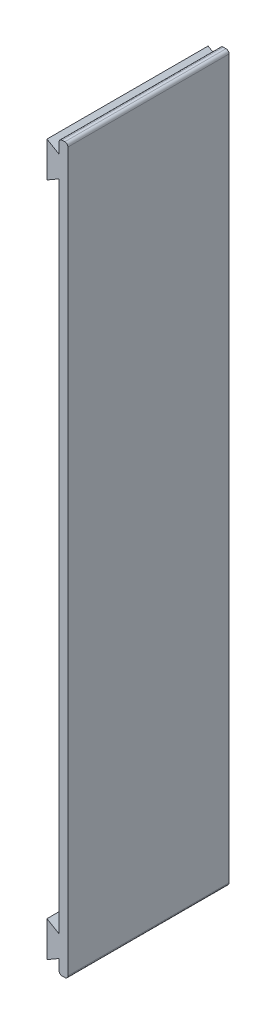
ISO-10303-21;
HEADER;
FILE_DESCRIPTION(('STEP AP214'),'2;1');
FILE_NAME('part.step','',(''),(''),'','','');
FILE_SCHEMA(('AUTOMOTIVE_DESIGN { 1 0 10303 214 1 1 1 1 }'));
ENDSEC;
DATA;
#1=APPLICATION_CONTEXT('core data for automotive mechanical design processes');
#2=APPLICATION_PROTOCOL_DEFINITION('international standard','automotive_design',2000,#1);
#3=PRODUCT_CONTEXT('',#1,'mechanical');
#4=PRODUCT('Part','Part','',(#3));
#5=PRODUCT_RELATED_PRODUCT_CATEGORY('part','',(#4));
#6=PRODUCT_DEFINITION_FORMATION('','',#4);
#7=PRODUCT_DEFINITION_CONTEXT('part definition',#1,'design');
#8=PRODUCT_DEFINITION('design','',#6,#7);
#9=PRODUCT_DEFINITION_SHAPE('','',#8);
#10=(LENGTH_UNIT() NAMED_UNIT(*) SI_UNIT(.MILLI.,.METRE.));
#11=(NAMED_UNIT(*) PLANE_ANGLE_UNIT() SI_UNIT($,.RADIAN.));
#12=(NAMED_UNIT(*) SI_UNIT($,.STERADIAN.) SOLID_ANGLE_UNIT());
#13=UNCERTAINTY_MEASURE_WITH_UNIT(LENGTH_MEASURE(1.E-05),#10,'distance_accuracy_value','');
#14=(GEOMETRIC_REPRESENTATION_CONTEXT(3) GLOBAL_UNCERTAINTY_ASSIGNED_CONTEXT((#13)) GLOBAL_UNIT_ASSIGNED_CONTEXT((#10,
#11,#12)) REPRESENTATION_CONTEXT('',''));
#15=CARTESIAN_POINT('',(0.,0.,0.));
#16=DIRECTION('',(0.,0.,1.));
#17=DIRECTION('',(1.,0.,0.));
#18=AXIS2_PLACEMENT_3D('',#15,#16,#17);
#19=CARTESIAN_POINT('',(2.9,0.,53.));
#20=DIRECTION('',(0.,-1.,0.));
#21=DIRECTION('',(1.,0.,0.));
#22=AXIS2_PLACEMENT_3D('',#19,#20,#21);
#23=PLANE('',#22);
#24=DIRECTION('',(-1.,0.,0.));
#25=VECTOR('',#24,1.);
#26=CARTESIAN_POINT('',(2.9,0.,53.));
#27=LINE('',#26,#25);
#28=CARTESIAN_POINT('',(1.9,0.,53.));
#29=VERTEX_POINT('',#28);
#30=CARTESIAN_POINT('',(1.,0.,53.));
#31=VERTEX_POINT('',#30);
#32=EDGE_CURVE('E228',#29,#31,#27,.T.);
#33=ORIENTED_EDGE('',*,*,#32,.F.);
#34=DIRECTION('',(0.,0.,-1.));
#35=VECTOR('',#34,1.);
#36=CARTESIAN_POINT('',(1.9,0.,53.));
#37=LINE('',#36,#35);
#38=CARTESIAN_POINT('',(1.9,0.,0.));
#39=VERTEX_POINT('',#38);
#40=EDGE_CURVE('E387',#29,#39,#37,.T.);
#41=ORIENTED_EDGE('',*,*,#40,.T.);
#42=DIRECTION('',(-1.,0.,0.));
#43=VECTOR('',#42,1.);
#44=CARTESIAN_POINT('',(2.9,0.,0.));
#45=LINE('',#44,#43);
#46=CARTESIAN_POINT('',(1.,0.,0.));
#47=VERTEX_POINT('',#46);
#48=EDGE_CURVE('E278',#39,#47,#45,.T.);
#49=ORIENTED_EDGE('',*,*,#48,.T.);
#50=DIRECTION('',(0.,0.,-1.));
#51=VECTOR('',#50,1.);
#52=CARTESIAN_POINT('',(1.,0.,53.));
#53=LINE('',#52,#51);
#54=EDGE_CURVE('E384',#47,#31,#53,.F.);
#55=ORIENTED_EDGE('',*,*,#54,.T.);
#56=EDGE_LOOP('',(#33,#41,#49,#55));
#57=FACE_BOUND('',#56,.T.);
#58=ADVANCED_FACE('F41',(#57),#23,.F.);
#59=CARTESIAN_POINT('',(0.,0.,53.));
#60=DIRECTION('',(1.,0.,0.));
#61=DIRECTION('',(0.,1.,0.));
#62=AXIS2_PLACEMENT_3D('',#59,#60,#61);
#63=PLANE('',#62);
#64=DIRECTION('',(0.,-1.,0.));
#65=VECTOR('',#64,1.);
#66=CARTESIAN_POINT('',(0.,0.,53.));
#67=LINE('',#66,#65);
#68=CARTESIAN_POINT('',(0.,-1.,53.));
#69=VERTEX_POINT('',#68);
#70=CARTESIAN_POINT('',(0.,-4.48,53.));
#71=VERTEX_POINT('',#70);
#72=EDGE_CURVE('E214',#69,#71,#67,.T.);
#73=ORIENTED_EDGE('',*,*,#72,.F.);
#74=DIRECTION('',(0.,0.,-1.));
#75=VECTOR('',#74,1.);
#76=CARTESIAN_POINT('',(0.,-1.,53.));
#77=LINE('',#76,#75);
#78=CARTESIAN_POINT('',(0.,-1.,0.));
#79=VERTEX_POINT('',#78);
#80=EDGE_CURVE('E391',#69,#79,#77,.T.);
#81=ORIENTED_EDGE('',*,*,#80,.T.);
#82=DIRECTION('',(0.,-1.,0.));
#83=VECTOR('',#82,1.);
#84=CARTESIAN_POINT('',(0.,0.,0.));
#85=LINE('',#84,#83);
#86=CARTESIAN_POINT('',(0.,-4.48,0.));
#87=VERTEX_POINT('',#86);
#88=EDGE_CURVE('E234',#79,#87,#85,.T.);
#89=ORIENTED_EDGE('',*,*,#88,.T.);
#90=DIRECTION('',(0.,0.,-1.));
#91=VECTOR('',#90,1.);
#92=CARTESIAN_POINT('',(0.,-4.48,53.));
#93=LINE('',#92,#91);
#94=EDGE_CURVE('E231',#71,#87,#93,.T.);
#95=ORIENTED_EDGE('',*,*,#94,.F.);
#96=EDGE_LOOP('',(#73,#81,#89,#95));
#97=FACE_BOUND('',#96,.T.);
#98=ADVANCED_FACE('F232',(#97),#63,.F.);
#99=CARTESIAN_POINT('',(0.,-4.48,53.));
#100=DIRECTION('',(-0.500000000000013,-0.866025403784431,0.));
#101=DIRECTION('',(0.866025403784431,-0.500000000000013,0.));
#102=AXIS2_PLACEMENT_3D('',#99,#100,#101);
#103=PLANE('',#102);
#104=DIRECTION('',(-0.866025403784431,0.500000000000013,0.));
#105=VECTOR('',#104,1.);
#106=CARTESIAN_POINT('',(0.,-4.48,0.));
#107=LINE('',#106,#105);
#108=CARTESIAN_POINT('',(-3.99237711144618,-2.17499999999997,0.));
#109=VERTEX_POINT('',#108);
#110=EDGE_CURVE('E285',#87,#109,#107,.T.);
#111=ORIENTED_EDGE('',*,*,#110,.T.);
#112=DIRECTION('',(0.,0.,-1.));
#113=VECTOR('',#112,1.);
#114=CARTESIAN_POINT('',(-3.99237711144618,-2.17499999999997,53.));
#115=LINE('',#114,#113);
#116=CARTESIAN_POINT('',(-3.99237711144618,-2.17499999999997,53.));
#117=VERTEX_POINT('',#116);
#118=EDGE_CURVE('E239',#117,#109,#115,.T.);
#119=ORIENTED_EDGE('',*,*,#118,.F.);
#120=DIRECTION('',(-0.866025403784431,0.500000000000013,0.));
#121=VECTOR('',#120,1.);
#122=CARTESIAN_POINT('',(0.,-4.48,53.));
#123=LINE('',#122,#121);
#124=EDGE_CURVE('E219',#71,#117,#123,.T.);
#125=ORIENTED_EDGE('',*,*,#124,.F.);
#126=ORIENTED_EDGE('',*,*,#94,.T.);
#127=EDGE_LOOP('',(#111,#119,#125,#126));
#128=FACE_BOUND('',#127,.T.);
#129=ADVANCED_FACE('F241',(#128),#103,.F.);
#130=CARTESIAN_POINT('',(-3.99237711144618,-2.17499999999997,53.));
#131=DIRECTION('',(1.,0.,0.));
#132=DIRECTION('',(0.,1.,0.));
#133=AXIS2_PLACEMENT_3D('',#130,#131,#132);
#134=PLANE('',#133);
#135=DIRECTION('',(0.,-1.,0.));
#136=VECTOR('',#135,1.);
#137=CARTESIAN_POINT('',(-3.99237711144618,-2.17499999999997,0.));
#138=LINE('',#137,#136);
#139=CARTESIAN_POINT('',(-3.99237711144618,-13.825,0.));
#140=VERTEX_POINT('',#139);
#141=EDGE_CURVE('E288',#109,#140,#138,.T.);
#142=ORIENTED_EDGE('',*,*,#141,.T.);
#143=DIRECTION('',(0.,0.,-1.));
#144=VECTOR('',#143,1.);
#145=CARTESIAN_POINT('',(-3.99237711144618,-13.825,53.));
#146=LINE('',#145,#144);
#147=CARTESIAN_POINT('',(-3.99237711144618,-13.825,53.));
#148=VERTEX_POINT('',#147);
#149=EDGE_CURVE('E339',#148,#140,#146,.T.);
#150=ORIENTED_EDGE('',*,*,#149,.F.);
#151=DIRECTION('',(0.,-1.,0.));
#152=VECTOR('',#151,1.);
#153=CARTESIAN_POINT('',(-3.99237711144618,-2.17499999999997,53.));
#154=LINE('',#153,#152);
#155=EDGE_CURVE('E245',#117,#148,#154,.T.);
#156=ORIENTED_EDGE('',*,*,#155,.F.);
#157=ORIENTED_EDGE('',*,*,#118,.T.);
#158=EDGE_LOOP('',(#142,#150,#156,#157));
#159=FACE_BOUND('',#158,.T.);
#160=ADVANCED_FACE('F525',(#159),#134,.F.);
#161=CARTESIAN_POINT('',(0.,-11.52,53.));
#162=DIRECTION('',(-0.499999999999998,0.86602540378444,0.));
#163=DIRECTION('',(-0.86602540378444,-0.499999999999998,0.));
#164=AXIS2_PLACEMENT_3D('',#161,#162,#163);
#165=PLANE('',#164);
#166=DIRECTION('',(0.86602540378444,0.499999999999998,0.));
#167=VECTOR('',#166,1.);
#168=CARTESIAN_POINT('',(0.,-11.52,0.));
#169=LINE('',#168,#167);
#170=CARTESIAN_POINT('',(0.,-11.52,0.));
#171=VERTEX_POINT('',#170);
#172=EDGE_CURVE('E291',#140,#171,#169,.T.);
#173=ORIENTED_EDGE('',*,*,#172,.T.);
#174=DIRECTION('',(0.,0.,-1.));
#175=VECTOR('',#174,1.);
#176=CARTESIAN_POINT('',(0.,-11.52,53.));
#177=LINE('',#176,#175);
#178=CARTESIAN_POINT('',(0.,-11.52,53.));
#179=VERTEX_POINT('',#178);
#180=EDGE_CURVE('E335',#179,#171,#177,.T.);
#181=ORIENTED_EDGE('',*,*,#180,.F.);
#182=DIRECTION('',(0.86602540378444,0.499999999999998,0.));
#183=VECTOR('',#182,1.);
#184=CARTESIAN_POINT('',(0.,-11.52,53.));
#185=LINE('',#184,#183);
#186=EDGE_CURVE('E248',#148,#179,#185,.T.);
#187=ORIENTED_EDGE('',*,*,#186,.F.);
#188=ORIENTED_EDGE('',*,*,#149,.T.);
#189=EDGE_LOOP('',(#173,#181,#187,#188));
#190=FACE_BOUND('',#189,.T.);
#191=ADVANCED_FACE('F532',(#190),#165,.F.);
#192=CARTESIAN_POINT('',(0.,-226.48,53.));
#193=DIRECTION('',(1.,0.,0.));
#194=DIRECTION('',(0.,1.,0.));
#195=AXIS2_PLACEMENT_3D('',#192,#193,#194);
#196=PLANE('',#195);
#197=DIRECTION('',(0.,0.,1.));
#198=VECTOR('',#197,1.);
#199=CARTESIAN_POINT('',(-2.12901654943528E-13,-58.5,0.));
#200=LINE('',#199,#198);
#201=CARTESIAN_POINT('',(-2.12901654943528E-13,-58.5,1.));
#202=VERTEX_POINT('',#201);
#203=CARTESIAN_POINT('',(-2.12901654943528E-13,-58.5,1.79999999999999));
#204=VERTEX_POINT('',#203);
#205=EDGE_CURVE('E497',#202,#204,#200,.T.);
#206=ORIENTED_EDGE('',*,*,#205,.T.);
#207=CARTESIAN_POINT('',(0.,-59.5,1.79999999999999));
#208=DIRECTION('',(1.,0.,0.));
#209=DIRECTION('',(0.,1.,0.));
#210=AXIS2_PLACEMENT_3D('',#207,#208,#209);
#211=CIRCLE('',#210,1.);
#212=CARTESIAN_POINT('',(-2.16540999472477E-13,-59.5,2.79999999999999));
#213=VERTEX_POINT('',#212);
#214=EDGE_CURVE('E11',#204,#213,#211,.T.);
#215=ORIENTED_EDGE('',*,*,#214,.T.);
#216=DIRECTION('',(0.,-1.,0.));
#217=VECTOR('',#216,1.);
#218=CARTESIAN_POINT('',(-2.12901654943528E-13,-58.5,2.79999999999999));
#219=LINE('',#218,#217);
#220=CARTESIAN_POINT('',(-6.49622998417432E-13,-178.5,2.79999999999998));
#221=VERTEX_POINT('',#220);
#222=EDGE_CURVE('E501',#213,#221,#219,.T.);
#223=ORIENTED_EDGE('',*,*,#222,.T.);
#224=CARTESIAN_POINT('',(0.,-178.5,1.79999999999998));
#225=DIRECTION('',(1.,0.,0.));
#226=DIRECTION('',(0.,1.,0.));
#227=AXIS2_PLACEMENT_3D('',#224,#225,#226);
#228=CIRCLE('',#227,1.);
#229=CARTESIAN_POINT('',(-6.53262342946381E-13,-179.5,1.79999999999998));
#230=VERTEX_POINT('',#229);
#231=EDGE_CURVE('E447',#221,#230,#228,.T.);
#232=ORIENTED_EDGE('',*,*,#231,.T.);
#233=DIRECTION('',(0.,0.,-1.));
#234=VECTOR('',#233,1.);
#235=CARTESIAN_POINT('',(-6.53262342946381E-13,-179.5,2.79999999999998));
#236=LINE('',#235,#234);
#237=CARTESIAN_POINT('',(-6.53262342946381E-13,-179.5,1.));
#238=VERTEX_POINT('',#237);
#239=EDGE_CURVE('E282',#230,#238,#236,.T.);
#240=ORIENTED_EDGE('',*,*,#239,.T.);
#241=CARTESIAN_POINT('',(0.,-178.5,1.));
#242=DIRECTION('',(1.,0.,0.));
#243=DIRECTION('',(0.,1.,0.));
#244=AXIS2_PLACEMENT_3D('',#241,#242,#243);
#245=CIRCLE('',#244,1.);
#246=CARTESIAN_POINT('',(0.,-178.5,0.));
#247=VERTEX_POINT('',#246);
#248=EDGE_CURVE('E443',#238,#247,#245,.T.);
#249=ORIENTED_EDGE('',*,*,#248,.T.);
#250=DIRECTION('',(0.,-1.,0.));
#251=VECTOR('',#250,1.);
#252=CARTESIAN_POINT('',(0.,-226.48,0.));
#253=LINE('',#252,#251);
#254=CARTESIAN_POINT('',(0.,-226.48,0.));
#255=VERTEX_POINT('',#254);
#256=EDGE_CURVE('E295',#247,#255,#253,.T.);
#257=ORIENTED_EDGE('',*,*,#256,.T.);
#258=DIRECTION('',(0.,0.,-1.));
#259=VECTOR('',#258,1.);
#260=CARTESIAN_POINT('',(0.,-226.48,53.));
#261=LINE('',#260,#259);
#262=CARTESIAN_POINT('',(0.,-226.48,53.));
#263=VERTEX_POINT('',#262);
#264=EDGE_CURVE('E331',#263,#255,#261,.T.);
#265=ORIENTED_EDGE('',*,*,#264,.F.);
#266=DIRECTION('',(0.,-1.,0.));
#267=VECTOR('',#266,1.);
#268=CARTESIAN_POINT('',(0.,-11.52,53.));
#269=LINE('',#268,#267);
#270=EDGE_CURVE('E254',#179,#263,#269,.T.);
#271=ORIENTED_EDGE('',*,*,#270,.F.);
#272=ORIENTED_EDGE('',*,*,#180,.T.);
#273=CARTESIAN_POINT('',(0.,-59.5,0.));
#274=VERTEX_POINT('',#273);
#275=EDGE_CURVE('E296',#171,#274,#253,.T.);
#276=ORIENTED_EDGE('',*,*,#275,.T.);
#277=CARTESIAN_POINT('',(0.,-59.5,1.));
#278=DIRECTION('',(1.,0.,0.));
#279=DIRECTION('',(0.,1.,0.));
#280=AXIS2_PLACEMENT_3D('',#277,#278,#279);
#281=CIRCLE('',#280,1.);
#282=EDGE_CURVE('E51',#274,#202,#281,.T.);
#283=ORIENTED_EDGE('',*,*,#282,.T.);
#284=EDGE_LOOP('',(#206,#215,#223,#232,#240,#249,#257,#265,#271,#272,#276,#283));
#285=FACE_BOUND('',#284,.T.);
#286=ADVANCED_FACE('F533',(#285),#196,.F.);
#287=CARTESIAN_POINT('',(0.,-226.48,53.));
#288=DIRECTION('',(-0.500000000000003,-0.866025403784437,0.));
#289=DIRECTION('',(0.866025403784437,-0.500000000000002,0.));
#290=AXIS2_PLACEMENT_3D('',#287,#288,#289);
#291=PLANE('',#290);
#292=DIRECTION('',(-0.866025403784437,0.500000000000002,0.));
#293=VECTOR('',#292,1.);
#294=CARTESIAN_POINT('',(0.,-226.48,0.));
#295=LINE('',#294,#293);
#296=CARTESIAN_POINT('',(-3.99237711144621,-224.175,0.));
#297=VERTEX_POINT('',#296);
#298=EDGE_CURVE('E299',#255,#297,#295,.T.);
#299=ORIENTED_EDGE('',*,*,#298,.T.);
#300=DIRECTION('',(0.,0.,-1.));
#301=VECTOR('',#300,1.);
#302=CARTESIAN_POINT('',(-3.99237711144621,-224.175,53.));
#303=LINE('',#302,#301);
#304=CARTESIAN_POINT('',(-3.99237711144621,-224.175,53.));
#305=VERTEX_POINT('',#304);
#306=EDGE_CURVE('E327',#305,#297,#303,.T.);
#307=ORIENTED_EDGE('',*,*,#306,.F.);
#308=DIRECTION('',(-0.866025403784437,0.500000000000002,0.));
#309=VECTOR('',#308,1.);
#310=CARTESIAN_POINT('',(0.,-226.48,53.));
#311=LINE('',#310,#309);
#312=EDGE_CURVE('E257',#263,#305,#311,.T.);
#313=ORIENTED_EDGE('',*,*,#312,.F.);
#314=ORIENTED_EDGE('',*,*,#264,.T.);
#315=EDGE_LOOP('',(#299,#307,#313,#314));
#316=FACE_BOUND('',#315,.T.);
#317=ADVANCED_FACE('F538',(#316),#291,.F.);
#318=CARTESIAN_POINT('',(-3.99237711144621,-235.825,53.));
#319=DIRECTION('',(1.,0.,0.));
#320=DIRECTION('',(0.,1.,0.));
#321=AXIS2_PLACEMENT_3D('',#318,#319,#320);
#322=PLANE('',#321);
#323=DIRECTION('',(0.,-1.,0.));
#324=VECTOR('',#323,1.);
#325=CARTESIAN_POINT('',(-3.99237711144621,-235.825,0.));
#326=LINE('',#325,#324);
#327=CARTESIAN_POINT('',(-3.99237711144621,-235.825,0.));
#328=VERTEX_POINT('',#327);
#329=EDGE_CURVE('E302',#297,#328,#326,.T.);
#330=ORIENTED_EDGE('',*,*,#329,.T.);
#331=DIRECTION('',(0.,0.,-1.));
#332=VECTOR('',#331,1.);
#333=CARTESIAN_POINT('',(-3.99237711144621,-235.825,53.));
#334=LINE('',#333,#332);
#335=CARTESIAN_POINT('',(-3.99237711144621,-235.825,53.));
#336=VERTEX_POINT('',#335);
#337=EDGE_CURVE('E323',#336,#328,#334,.T.);
#338=ORIENTED_EDGE('',*,*,#337,.F.);
#339=DIRECTION('',(0.,-1.,0.));
#340=VECTOR('',#339,1.);
#341=CARTESIAN_POINT('',(-3.99237711144621,-235.825,53.));
#342=LINE('',#341,#340);
#343=EDGE_CURVE('E260',#305,#336,#342,.T.);
#344=ORIENTED_EDGE('',*,*,#343,.F.);
#345=ORIENTED_EDGE('',*,*,#306,.T.);
#346=EDGE_LOOP('',(#330,#338,#344,#345));
#347=FACE_BOUND('',#346,.T.);
#348=ADVANCED_FACE('F544',(#347),#322,.F.);
#349=CARTESIAN_POINT('',(0.,-233.52,53.));
#350=DIRECTION('',(-0.499999999999996,0.866025403784441,0.));
#351=DIRECTION('',(-0.866025403784441,-0.499999999999996,0.));
#352=AXIS2_PLACEMENT_3D('',#349,#350,#351);
#353=PLANE('',#352);
#354=DIRECTION('',(0.866025403784441,0.499999999999996,0.));
#355=VECTOR('',#354,1.);
#356=CARTESIAN_POINT('',(0.,-233.52,0.));
#357=LINE('',#356,#355);
#358=CARTESIAN_POINT('',(0.,-233.52,0.));
#359=VERTEX_POINT('',#358);
#360=EDGE_CURVE('E305',#328,#359,#357,.T.);
#361=ORIENTED_EDGE('',*,*,#360,.T.);
#362=DIRECTION('',(0.,0.,-1.));
#363=VECTOR('',#362,1.);
#364=CARTESIAN_POINT('',(0.,-233.52,53.));
#365=LINE('',#364,#363);
#366=CARTESIAN_POINT('',(0.,-233.52,53.));
#367=VERTEX_POINT('',#366);
#368=EDGE_CURVE('E277',#367,#359,#365,.T.);
#369=ORIENTED_EDGE('',*,*,#368,.F.);
#370=DIRECTION('',(0.866025403784441,0.499999999999996,0.));
#371=VECTOR('',#370,1.);
#372=CARTESIAN_POINT('',(0.,-233.52,53.));
#373=LINE('',#372,#371);
#374=EDGE_CURVE('E263',#336,#367,#373,.T.);
#375=ORIENTED_EDGE('',*,*,#374,.F.);
#376=ORIENTED_EDGE('',*,*,#337,.T.);
#377=EDGE_LOOP('',(#361,#369,#375,#376));
#378=FACE_BOUND('',#377,.T.);
#379=ADVANCED_FACE('F548',(#378),#353,.F.);
#380=CARTESIAN_POINT('',(0.,-238.,53.));
#381=DIRECTION('',(1.,0.,0.));
#382=DIRECTION('',(0.,1.,0.));
#383=AXIS2_PLACEMENT_3D('',#380,#381,#382);
#384=PLANE('',#383);
#385=DIRECTION('',(0.,-1.,0.));
#386=VECTOR('',#385,1.);
#387=CARTESIAN_POINT('',(0.,-238.,0.));
#388=LINE('',#387,#386);
#389=CARTESIAN_POINT('',(0.,-237.,0.));
#390=VERTEX_POINT('',#389);
#391=EDGE_CURVE('E308',#359,#390,#388,.T.);
#392=ORIENTED_EDGE('',*,*,#391,.T.);
#393=DIRECTION('',(0.,0.,-1.));
#394=VECTOR('',#393,1.);
#395=CARTESIAN_POINT('',(0.,-237.,53.));
#396=LINE('',#395,#394);
#397=CARTESIAN_POINT('',(0.,-237.,53.));
#398=VERTEX_POINT('',#397);
#399=EDGE_CURVE('E363',#390,#398,#396,.F.);
#400=ORIENTED_EDGE('',*,*,#399,.T.);
#401=DIRECTION('',(0.,-1.,0.));
#402=VECTOR('',#401,1.);
#403=CARTESIAN_POINT('',(0.,-238.,53.));
#404=LINE('',#403,#402);
#405=EDGE_CURVE('E266',#367,#398,#404,.T.);
#406=ORIENTED_EDGE('',*,*,#405,.F.);
#407=ORIENTED_EDGE('',*,*,#368,.T.);
#408=EDGE_LOOP('',(#392,#400,#406,#407));
#409=FACE_BOUND('',#408,.T.);
#410=ADVANCED_FACE('F552',(#409),#384,.F.);
#411=CARTESIAN_POINT('',(2.9,-238.,53.));
#412=DIRECTION('',(0.,1.,0.));
#413=DIRECTION('',(-1.,0.,0.));
#414=AXIS2_PLACEMENT_3D('',#411,#412,#413);
#415=PLANE('',#414);
#416=DIRECTION('',(1.,0.,0.));
#417=VECTOR('',#416,1.);
#418=CARTESIAN_POINT('',(2.9,-238.,53.));
#419=LINE('',#418,#417);
#420=CARTESIAN_POINT('',(0.999999999999991,-238.,53.));
#421=VERTEX_POINT('',#420);
#422=CARTESIAN_POINT('',(1.89999999999999,-238.,53.));
#423=VERTEX_POINT('',#422);
#424=EDGE_CURVE('E269',#421,#423,#419,.T.);
#425=ORIENTED_EDGE('',*,*,#424,.F.);
#426=DIRECTION('',(0.,0.,-1.));
#427=VECTOR('',#426,1.);
#428=CARTESIAN_POINT('',(0.999999999999991,-238.,53.));
#429=LINE('',#428,#427);
#430=CARTESIAN_POINT('',(0.999999999999991,-238.,0.));
#431=VERTEX_POINT('',#430);
#432=EDGE_CURVE('E347',#421,#431,#429,.T.);
#433=ORIENTED_EDGE('',*,*,#432,.T.);
#434=DIRECTION('',(1.,0.,0.));
#435=VECTOR('',#434,1.);
#436=CARTESIAN_POINT('',(2.9,-238.,0.));
#437=LINE('',#436,#435);
#438=CARTESIAN_POINT('',(1.89999999999999,-238.,0.));
#439=VERTEX_POINT('',#438);
#440=EDGE_CURVE('E312',#431,#439,#437,.T.);
#441=ORIENTED_EDGE('',*,*,#440,.T.);
#442=DIRECTION('',(0.,0.,-1.));
#443=VECTOR('',#442,1.);
#444=CARTESIAN_POINT('',(1.89999999999999,-238.,53.));
#445=LINE('',#444,#443);
#446=EDGE_CURVE('E238',#439,#423,#445,.F.);
#447=ORIENTED_EDGE('',*,*,#446,.T.);
#448=EDGE_LOOP('',(#425,#433,#441,#447));
#449=FACE_BOUND('',#448,.T.);
#450=ADVANCED_FACE('F561',(#449),#415,.F.);
#451=CARTESIAN_POINT('',(2.9,-7.4587695629972,53.));
#452=DIRECTION('',(-1.,0.,0.));
#453=DIRECTION('',(0.,0.,1.));
#454=AXIS2_PLACEMENT_3D('',#451,#452,#453);
#455=PLANE('',#454);
#456=DIRECTION('',(0.,1.,0.));
#457=VECTOR('',#456,1.);
#458=CARTESIAN_POINT('',(2.9,-230.541230437003,53.));
#459=LINE('',#458,#457);
#460=CARTESIAN_POINT('',(2.9,-237.,53.));
#461=VERTEX_POINT('',#460);
#462=CARTESIAN_POINT('',(2.9,-1.,53.));
#463=VERTEX_POINT('',#462);
#464=EDGE_CURVE('E273',#461,#463,#459,.T.);
#465=ORIENTED_EDGE('',*,*,#464,.F.);
#466=DIRECTION('',(0.,0.,-1.));
#467=VECTOR('',#466,1.);
#468=CARTESIAN_POINT('',(2.9,-237.,53.));
#469=LINE('',#468,#467);
#470=CARTESIAN_POINT('',(2.9,-237.,0.));
#471=VERTEX_POINT('',#470);
#472=EDGE_CURVE('E380',#461,#471,#469,.T.);
#473=ORIENTED_EDGE('',*,*,#472,.T.);
#474=DIRECTION('',(0.,1.,0.));
#475=VECTOR('',#474,1.);
#476=CARTESIAN_POINT('',(2.9,-7.4587695629972,0.));
#477=LINE('',#476,#475);
#478=CARTESIAN_POINT('',(2.9,-1.,0.));
#479=VERTEX_POINT('',#478);
#480=EDGE_CURVE('E316',#471,#479,#477,.T.);
#481=ORIENTED_EDGE('',*,*,#480,.T.);
#482=DIRECTION('',(0.,0.,-1.));
#483=VECTOR('',#482,1.);
#484=CARTESIAN_POINT('',(2.9,-1.,53.));
#485=LINE('',#484,#483);
#486=EDGE_CURVE('E377',#479,#463,#485,.F.);
#487=ORIENTED_EDGE('',*,*,#486,.T.);
#488=EDGE_LOOP('',(#465,#473,#481,#487));
#489=FACE_BOUND('',#488,.T.);
#490=ADVANCED_FACE('F570',(#489),#455,.F.);
#491=CARTESIAN_POINT('',(0.,0.,53.));
#492=DIRECTION('',(0.,0.,1.));
#493=DIRECTION('',(1.,0.,0.));
#494=AXIS2_PLACEMENT_3D('',#491,#492,#493);
#495=PLANE('',#494);
#496=ORIENTED_EDGE('',*,*,#405,.T.);
#497=CARTESIAN_POINT('',(1.,-237.,53.));
#498=DIRECTION('',(0.,0.,1.));
#499=DIRECTION('',(1.,0.,0.));
#500=AXIS2_PLACEMENT_3D('',#497,#498,#499);
#501=CIRCLE('',#500,1.);
#502=EDGE_CURVE('E374',#398,#421,#501,.T.);
#503=ORIENTED_EDGE('',*,*,#502,.T.);
#504=ORIENTED_EDGE('',*,*,#424,.T.);
#505=CARTESIAN_POINT('',(1.9,-237.,53.));
#506=DIRECTION('',(0.,0.,1.));
#507=DIRECTION('',(1.,0.,0.));
#508=AXIS2_PLACEMENT_3D('',#505,#506,#507);
#509=CIRCLE('',#508,1.);
#510=EDGE_CURVE('E371',#423,#461,#509,.T.);
#511=ORIENTED_EDGE('',*,*,#510,.T.);
#512=ORIENTED_EDGE('',*,*,#464,.T.);
#513=CARTESIAN_POINT('',(1.9,-1.,53.));
#514=DIRECTION('',(0.,0.,1.));
#515=DIRECTION('',(1.,0.,0.));
#516=AXIS2_PLACEMENT_3D('',#513,#514,#515);
#517=CIRCLE('',#516,1.);
#518=EDGE_CURVE('E368',#463,#29,#517,.T.);
#519=ORIENTED_EDGE('',*,*,#518,.T.);
#520=ORIENTED_EDGE('',*,*,#32,.T.);
#521=CARTESIAN_POINT('',(1.,-1.,53.));
#522=DIRECTION('',(0.,0.,1.));
#523=DIRECTION('',(1.,0.,0.));
#524=AXIS2_PLACEMENT_3D('',#521,#522,#523);
#525=CIRCLE('',#524,1.);
#526=EDGE_CURVE('E223',#31,#69,#525,.T.);
#527=ORIENTED_EDGE('',*,*,#526,.T.);
#528=ORIENTED_EDGE('',*,*,#72,.T.);
#529=ORIENTED_EDGE('',*,*,#124,.T.);
#530=ORIENTED_EDGE('',*,*,#155,.T.);
#531=ORIENTED_EDGE('',*,*,#186,.T.);
#532=ORIENTED_EDGE('',*,*,#270,.T.);
#533=ORIENTED_EDGE('',*,*,#312,.T.);
#534=ORIENTED_EDGE('',*,*,#343,.T.);
#535=ORIENTED_EDGE('',*,*,#374,.T.);
#536=EDGE_LOOP('',(#496,#503,#504,#511,#512,#519,#520,#527,#528,#529,#530,#531,#532,#533,#534,#535));
#537=FACE_BOUND('',#536,.T.);
#538=ADVANCED_FACE('F217',(#537),#495,.T.);
#539=CARTESIAN_POINT('',(0.,0.,0.));
#540=DIRECTION('',(0.,0.,1.));
#541=DIRECTION('',(1.,0.,0.));
#542=AXIS2_PLACEMENT_3D('',#539,#540,#541);
#543=PLANE('',#542);
#544=DIRECTION('',(1.,0.,0.));
#545=VECTOR('',#544,1.);
#546=CARTESIAN_POINT('',(0.,-59.5,0.));
#547=LINE('',#546,#545);
#548=CARTESIAN_POINT('',(-7.00000000000022,-59.5,0.));
#549=VERTEX_POINT('',#548);
#550=EDGE_CURVE('E420',#549,#274,#547,.T.);
#551=ORIENTED_EDGE('',*,*,#550,.T.);
#552=ORIENTED_EDGE('',*,*,#275,.F.);
#553=ORIENTED_EDGE('',*,*,#172,.F.);
#554=ORIENTED_EDGE('',*,*,#141,.F.);
#555=ORIENTED_EDGE('',*,*,#110,.F.);
#556=ORIENTED_EDGE('',*,*,#88,.F.);
#557=CARTESIAN_POINT('',(1.,-1.,0.));
#558=DIRECTION('',(0.,0.,1.));
#559=DIRECTION('',(1.,0.,0.));
#560=AXIS2_PLACEMENT_3D('',#557,#558,#559);
#561=CIRCLE('',#560,1.);
#562=EDGE_CURVE('E351',#79,#47,#561,.F.);
#563=ORIENTED_EDGE('',*,*,#562,.T.);
#564=ORIENTED_EDGE('',*,*,#48,.F.);
#565=CARTESIAN_POINT('',(1.9,-1.,0.));
#566=DIRECTION('',(0.,0.,1.));
#567=DIRECTION('',(1.,0.,0.));
#568=AXIS2_PLACEMENT_3D('',#565,#566,#567);
#569=CIRCLE('',#568,1.);
#570=EDGE_CURVE('E354',#39,#479,#569,.F.);
#571=ORIENTED_EDGE('',*,*,#570,.T.);
#572=ORIENTED_EDGE('',*,*,#480,.F.);
#573=CARTESIAN_POINT('',(1.9,-237.,0.));
#574=DIRECTION('',(0.,0.,1.));
#575=DIRECTION('',(1.,0.,0.));
#576=AXIS2_PLACEMENT_3D('',#573,#574,#575);
#577=CIRCLE('',#576,1.);
#578=EDGE_CURVE('E357',#471,#439,#577,.F.);
#579=ORIENTED_EDGE('',*,*,#578,.T.);
#580=ORIENTED_EDGE('',*,*,#440,.F.);
#581=CARTESIAN_POINT('',(1.,-237.,0.));
#582=DIRECTION('',(0.,0.,1.));
#583=DIRECTION('',(1.,0.,0.));
#584=AXIS2_PLACEMENT_3D('',#581,#582,#583);
#585=CIRCLE('',#584,1.);
#586=EDGE_CURVE('E360',#431,#390,#585,.F.);
#587=ORIENTED_EDGE('',*,*,#586,.T.);
#588=ORIENTED_EDGE('',*,*,#391,.F.);
#589=ORIENTED_EDGE('',*,*,#360,.F.);
#590=ORIENTED_EDGE('',*,*,#329,.F.);
#591=ORIENTED_EDGE('',*,*,#298,.F.);
#592=ORIENTED_EDGE('',*,*,#256,.F.);
#593=DIRECTION('',(1.,0.,0.));
#594=VECTOR('',#593,1.);
#595=CARTESIAN_POINT('',(-8.00000000000065,-178.5,0.));
#596=LINE('',#595,#594);
#597=CARTESIAN_POINT('',(-7.00000000000065,-178.5,0.));
#598=VERTEX_POINT('',#597);
#599=EDGE_CURVE('E424',#247,#598,#596,.F.);
#600=ORIENTED_EDGE('',*,*,#599,.T.);
#601=DIRECTION('',(0.,1.,0.));
#602=VECTOR('',#601,1.);
#603=CARTESIAN_POINT('',(-7.,0.,0.));
#604=LINE('',#603,#602);
#605=EDGE_CURVE('E417',#598,#549,#604,.T.);
#606=ORIENTED_EDGE('',*,*,#605,.T.);
#607=EDGE_LOOP('',(#551,#552,#553,#554,#555,#556,#563,#564,#571,#572,#579,#580,#587,#588,#589,
#590,#591,#592,#600,#606));
#608=FACE_BOUND('',#607,.T.);
#609=ADVANCED_FACE('F520',(#608),#543,.F.);
#610=CARTESIAN_POINT('',(-8.00000000000065,-179.5,2.79999999999998));
#611=DIRECTION('',(0.,-1.,0.));
#612=DIRECTION('',(1.,0.,0.));
#613=AXIS2_PLACEMENT_3D('',#610,#611,#612);
#614=PLANE('',#613);
#615=DIRECTION('',(0.,0.,-1.));
#616=VECTOR('',#615,1.);
#617=CARTESIAN_POINT('',(-7.00000000000065,-179.5,0.));
#618=LINE('',#617,#616);
#619=CARTESIAN_POINT('',(-7.00000000000065,-179.5,1.79999999999998));
#620=VERTEX_POINT('',#619);
#621=CARTESIAN_POINT('',(-7.00000000000065,-179.5,1.));
#622=VERTEX_POINT('',#621);
#623=EDGE_CURVE('E397',#620,#622,#618,.T.);
#624=ORIENTED_EDGE('',*,*,#623,.T.);
#625=DIRECTION('',(1.,0.,0.));
#626=VECTOR('',#625,1.);
#627=CARTESIAN_POINT('',(-6.54160648020252E-13,-179.5,1.));
#628=LINE('',#627,#626);
#629=EDGE_CURVE('E401',#622,#238,#628,.T.);
#630=ORIENTED_EDGE('',*,*,#629,.T.);
#631=ORIENTED_EDGE('',*,*,#239,.F.);
#632=DIRECTION('',(1.,0.,0.));
#633=VECTOR('',#632,1.);
#634=CARTESIAN_POINT('',(-8.00000000000065,-179.5,1.79999999999998));
#635=LINE('',#634,#633);
#636=EDGE_CURVE('E394',#230,#620,#635,.F.);
#637=ORIENTED_EDGE('',*,*,#636,.T.);
#638=EDGE_LOOP('',(#624,#630,#631,#637));
#639=FACE_BOUND('',#638,.T.);
#640=ADVANCED_FACE('F662',(#639),#614,.T.);
#641=CARTESIAN_POINT('',(-8.00000000000021,-58.5,2.79999999999999));
#642=DIRECTION('',(0.,0.,1.));
#643=DIRECTION('',(0.,-1.,0.));
#644=AXIS2_PLACEMENT_3D('',#641,#642,#643);
#645=PLANE('',#644);
#646=DIRECTION('',(0.,-1.,0.));
#647=VECTOR('',#646,1.);
#648=CARTESIAN_POINT('',(-7.00000000000065,-179.5,2.79999999999998));
#649=LINE('',#648,#647);
#650=CARTESIAN_POINT('',(-7.00000000000022,-59.5,2.79999999999999));
#651=VERTEX_POINT('',#650);
#652=CARTESIAN_POINT('',(-7.00000000000065,-178.5,2.79999999999998));
#653=VERTEX_POINT('',#652);
#654=EDGE_CURVE('E427',#651,#653,#649,.T.);
#655=ORIENTED_EDGE('',*,*,#654,.T.);
#656=DIRECTION('',(1.,0.,0.));
#657=VECTOR('',#656,1.);
#658=CARTESIAN_POINT('',(-8.00000000000065,-178.5,2.79999999999998));
#659=LINE('',#658,#657);
#660=EDGE_CURVE('E433',#653,#221,#659,.T.);
#661=ORIENTED_EDGE('',*,*,#660,.T.);
#662=ORIENTED_EDGE('',*,*,#222,.F.);
#663=DIRECTION('',(1.,0.,0.));
#664=VECTOR('',#663,1.);
#665=CARTESIAN_POINT('',(-8.00000000000022,-59.5,2.79999999999999));
#666=LINE('',#665,#664);
#667=EDGE_CURVE('E430',#213,#651,#666,.F.);
#668=ORIENTED_EDGE('',*,*,#667,.T.);
#669=EDGE_LOOP('',(#655,#661,#662,#668));
#670=FACE_BOUND('',#669,.T.);
#671=ADVANCED_FACE('F653',(#670),#645,.T.);
#672=CARTESIAN_POINT('',(-8.00000000000021,-58.5,0.));
#673=DIRECTION('',(0.,1.,0.));
#674=DIRECTION('',(-1.,0.,0.));
#675=AXIS2_PLACEMENT_3D('',#672,#673,#674);
#676=PLANE('',#675);
#677=ORIENTED_EDGE('',*,*,#205,.F.);
#678=DIRECTION('',(1.,0.,0.));
#679=VECTOR('',#678,1.);
#680=CARTESIAN_POINT('',(-8.00000000000021,-58.5,1.));
#681=LINE('',#680,#679);
#682=CARTESIAN_POINT('',(-7.00000000000021,-58.5,1.));
#683=VERTEX_POINT('',#682);
#684=EDGE_CURVE('E59',#202,#683,#681,.F.);
#685=ORIENTED_EDGE('',*,*,#684,.T.);
#686=DIRECTION('',(0.,0.,1.));
#687=VECTOR('',#686,1.);
#688=CARTESIAN_POINT('',(-7.00000000000021,-58.5,2.79999999999999));
#689=LINE('',#688,#687);
#690=CARTESIAN_POINT('',(-7.00000000000021,-58.5,1.79999999999999));
#691=VERTEX_POINT('',#690);
#692=EDGE_CURVE('E63',#683,#691,#689,.T.);
#693=ORIENTED_EDGE('',*,*,#692,.T.);
#694=DIRECTION('',(1.,0.,0.));
#695=VECTOR('',#694,1.);
#696=CARTESIAN_POINT('',(-8.00000000000021,-58.5,1.79999999999999));
#697=LINE('',#696,#695);
#698=EDGE_CURVE('E436',#691,#204,#697,.T.);
#699=ORIENTED_EDGE('',*,*,#698,.T.);
#700=EDGE_LOOP('',(#677,#685,#693,#699));
#701=FACE_BOUND('',#700,.T.);
#702=ADVANCED_FACE('F639',(#701),#676,.T.);
#703=CARTESIAN_POINT('',(-8.,0.,0.));
#704=DIRECTION('',(1.,0.,0.));
#705=DIRECTION('',(0.,1.,0.));
#706=AXIS2_PLACEMENT_3D('',#703,#704,#705);
#707=PLANE('',#706);
#708=DIRECTION('',(0.,0.,1.));
#709=VECTOR('',#708,1.);
#710=CARTESIAN_POINT('',(-8.00000000000022,-59.5,0.));
#711=LINE('',#710,#709);
#712=CARTESIAN_POINT('',(-8.00000000000022,-59.5,1.79999999999999));
#713=VERTEX_POINT('',#712);
#714=CARTESIAN_POINT('',(-8.00000000000022,-59.5,1.));
#715=VERTEX_POINT('',#714);
#716=EDGE_CURVE('E407',#713,#715,#711,.F.);
#717=ORIENTED_EDGE('',*,*,#716,.T.);
#718=DIRECTION('',(0.,1.,0.));
#719=VECTOR('',#718,1.);
#720=CARTESIAN_POINT('',(-8.,0.,1.));
#721=LINE('',#720,#719);
#722=CARTESIAN_POINT('',(-8.00000000000065,-178.5,1.));
#723=VERTEX_POINT('',#722);
#724=EDGE_CURVE('E414',#715,#723,#721,.F.);
#725=ORIENTED_EDGE('',*,*,#724,.T.);
#726=DIRECTION('',(0.,0.,-1.));
#727=VECTOR('',#726,1.);
#728=CARTESIAN_POINT('',(-8.00000000000065,-178.5,2.79999999999998));
#729=LINE('',#728,#727);
#730=CARTESIAN_POINT('',(-8.00000000000065,-178.5,1.79999999999998));
#731=VERTEX_POINT('',#730);
#732=EDGE_CURVE('E410',#723,#731,#729,.F.);
#733=ORIENTED_EDGE('',*,*,#732,.T.);
#734=DIRECTION('',(0.,-1.,0.));
#735=VECTOR('',#734,1.);
#736=CARTESIAN_POINT('',(-8.00000000000021,-58.5,1.79999999999999));
#737=LINE('',#736,#735);
#738=EDGE_CURVE('E404',#731,#713,#737,.F.);
#739=ORIENTED_EDGE('',*,*,#738,.T.);
#740=EDGE_LOOP('',(#717,#725,#733,#739));
#741=FACE_BOUND('',#740,.T.);
#742=ADVANCED_FACE('F584',(#741),#707,.F.);
#743=CARTESIAN_POINT('',(1.,-237.,53.));
#744=DIRECTION('',(0.,0.,-1.));
#745=DIRECTION('',(-1.,0.,0.));
#746=AXIS2_PLACEMENT_3D('',#743,#744,#745);
#747=CYLINDRICAL_SURFACE('',#746,1.);
#748=ORIENTED_EDGE('',*,*,#502,.F.);
#749=ORIENTED_EDGE('',*,*,#399,.F.);
#750=ORIENTED_EDGE('',*,*,#586,.F.);
#751=ORIENTED_EDGE('',*,*,#432,.F.);
#752=EDGE_LOOP('',(#748,#749,#750,#751));
#753=FACE_BOUND('',#752,.T.);
#754=ADVANCED_FACE('F558',(#753),#747,.T.);
#755=CARTESIAN_POINT('',(1.9,-237.,53.));
#756=DIRECTION('',(0.,0.,-1.));
#757=DIRECTION('',(-1.,0.,0.));
#758=AXIS2_PLACEMENT_3D('',#755,#756,#757);
#759=CYLINDRICAL_SURFACE('',#758,1.);
#760=ORIENTED_EDGE('',*,*,#510,.F.);
#761=ORIENTED_EDGE('',*,*,#446,.F.);
#762=ORIENTED_EDGE('',*,*,#578,.F.);
#763=ORIENTED_EDGE('',*,*,#472,.F.);
#764=EDGE_LOOP('',(#760,#761,#762,#763));
#765=FACE_BOUND('',#764,.T.);
#766=ADVANCED_FACE('F567',(#765),#759,.T.);
#767=CARTESIAN_POINT('',(1.9,-1.,53.));
#768=DIRECTION('',(0.,0.,-1.));
#769=DIRECTION('',(-1.,0.,0.));
#770=AXIS2_PLACEMENT_3D('',#767,#768,#769);
#771=CYLINDRICAL_SURFACE('',#770,1.);
#772=ORIENTED_EDGE('',*,*,#518,.F.);
#773=ORIENTED_EDGE('',*,*,#486,.F.);
#774=ORIENTED_EDGE('',*,*,#570,.F.);
#775=ORIENTED_EDGE('',*,*,#40,.F.);
#776=EDGE_LOOP('',(#772,#773,#774,#775));
#777=FACE_BOUND('',#776,.T.);
#778=ADVANCED_FACE('F573',(#777),#771,.T.);
#779=CARTESIAN_POINT('',(1.,-1.,53.));
#780=DIRECTION('',(0.,0.,-1.));
#781=DIRECTION('',(-1.,0.,0.));
#782=AXIS2_PLACEMENT_3D('',#779,#780,#781);
#783=CYLINDRICAL_SURFACE('',#782,1.);
#784=ORIENTED_EDGE('',*,*,#526,.F.);
#785=ORIENTED_EDGE('',*,*,#54,.F.);
#786=ORIENTED_EDGE('',*,*,#562,.F.);
#787=ORIENTED_EDGE('',*,*,#80,.F.);
#788=EDGE_LOOP('',(#784,#785,#786,#787));
#789=FACE_BOUND('',#788,.T.);
#790=ADVANCED_FACE('F518',(#789),#783,.T.);
#791=CARTESIAN_POINT('',(-8.00000000000022,-59.5,1.79999999999999));
#792=DIRECTION('',(1.,0.,0.));
#793=DIRECTION('',(0.,1.,0.));
#794=AXIS2_PLACEMENT_3D('',#791,#792,#793);
#795=CYLINDRICAL_SURFACE('',#794,1.);
#796=ORIENTED_EDGE('',*,*,#214,.F.);
#797=ORIENTED_EDGE('',*,*,#698,.F.);
#798=CARTESIAN_POINT('',(-7.00000000000022,-59.5,1.79999999999999));
#799=DIRECTION('',(-1.,0.,0.));
#800=DIRECTION('',(0.,-1.,0.));
#801=AXIS2_PLACEMENT_3D('',#798,#799,#800);
#802=CIRCLE('',#801,1.);
#803=EDGE_CURVE('E489',#651,#691,#802,.T.);
#804=ORIENTED_EDGE('',*,*,#803,.F.);
#805=ORIENTED_EDGE('',*,*,#667,.F.);
#806=EDGE_LOOP('',(#796,#797,#804,#805));
#807=FACE_BOUND('',#806,.T.);
#808=ADVANCED_FACE('F43',(#807),#795,.T.);
#809=CARTESIAN_POINT('',(-2.16540999472477E-13,-59.5,1.));
#810=DIRECTION('',(-1.,0.,0.));
#811=DIRECTION('',(0.,-1.,0.));
#812=AXIS2_PLACEMENT_3D('',#809,#810,#811);
#813=CYLINDRICAL_SURFACE('',#812,1.);
#814=ORIENTED_EDGE('',*,*,#282,.F.);
#815=ORIENTED_EDGE('',*,*,#550,.F.);
#816=CARTESIAN_POINT('',(-7.00000000000022,-59.5,1.));
#817=DIRECTION('',(-1.,0.,0.));
#818=DIRECTION('',(0.,-1.,0.));
#819=AXIS2_PLACEMENT_3D('',#816,#817,#818);
#820=CIRCLE('',#819,1.);
#821=EDGE_CURVE('E486',#683,#549,#820,.T.);
#822=ORIENTED_EDGE('',*,*,#821,.F.);
#823=ORIENTED_EDGE('',*,*,#684,.F.);
#824=EDGE_LOOP('',(#814,#815,#822,#823));
#825=FACE_BOUND('',#824,.T.);
#826=ADVANCED_FACE('F628',(#825),#813,.T.);
#827=CARTESIAN_POINT('',(-7.00000000000022,-59.5,0.));
#828=DIRECTION('',(0.,0.,-1.));
#829=DIRECTION('',(-1.,0.,0.));
#830=AXIS2_PLACEMENT_3D('',#827,#828,#829);
#831=CYLINDRICAL_SURFACE('',#830,1.);
#832=CARTESIAN_POINT('',(-7.00000000000022,-59.5,1.79999999999999));
#833=DIRECTION('',(0.,0.,1.));
#834=DIRECTION('',(1.,0.,0.));
#835=AXIS2_PLACEMENT_3D('',#832,#833,#834);
#836=CIRCLE('',#835,1.);
#837=EDGE_CURVE('E45',#691,#713,#836,.T.);
#838=ORIENTED_EDGE('',*,*,#837,.F.);
#839=ORIENTED_EDGE('',*,*,#692,.F.);
#840=CARTESIAN_POINT('',(-7.00000000000022,-59.5,1.));
#841=DIRECTION('',(0.,0.,-1.));
#842=DIRECTION('',(-1.,0.,0.));
#843=AXIS2_PLACEMENT_3D('',#840,#841,#842);
#844=CIRCLE('',#843,1.);
#845=EDGE_CURVE('E482',#715,#683,#844,.T.);
#846=ORIENTED_EDGE('',*,*,#845,.F.);
#847=ORIENTED_EDGE('',*,*,#716,.F.);
#848=EDGE_LOOP('',(#838,#839,#846,#847));
#849=FACE_BOUND('',#848,.T.);
#850=ADVANCED_FACE('F626',(#849),#831,.T.);
#851=CARTESIAN_POINT('',(-7.00000000000022,-59.5,1.79999999999999));
#852=DIRECTION('',(0.,1.,0.));
#853=DIRECTION('',(-1.,0.,0.));
#854=AXIS2_PLACEMENT_3D('',#851,#852,#853);
#855=SPHERICAL_SURFACE('',#854,1.);
#856=ORIENTED_EDGE('',*,*,#803,.T.);
#857=ORIENTED_EDGE('',*,*,#837,.T.);
#858=CARTESIAN_POINT('',(-7.00000000000022,-59.5,1.79999999999999));
#859=DIRECTION('',(0.,1.,0.));
#860=DIRECTION('',(-1.,0.,0.));
#861=AXIS2_PLACEMENT_3D('',#858,#859,#860);
#862=CIRCLE('',#861,1.);
#863=EDGE_CURVE('E478',#651,#713,#862,.F.);
#864=ORIENTED_EDGE('',*,*,#863,.F.);
#865=EDGE_LOOP('',(#856,#857,#864));
#866=FACE_BOUND('',#865,.T.);
#867=ADVANCED_FACE('F622',(#866),#855,.T.);
#868=CARTESIAN_POINT('',(-7.00000000000022,-59.5,1.));
#869=DIRECTION('',(0.,1.,0.));
#870=DIRECTION('',(-1.,0.,0.));
#871=AXIS2_PLACEMENT_3D('',#868,#869,#870);
#872=SPHERICAL_SURFACE('',#871,1.);
#873=ORIENTED_EDGE('',*,*,#845,.T.);
#874=ORIENTED_EDGE('',*,*,#821,.T.);
#875=CARTESIAN_POINT('',(-7.00000000000022,-59.5,1.));
#876=DIRECTION('',(0.,1.,0.));
#877=DIRECTION('',(0.,0.,1.));
#878=AXIS2_PLACEMENT_3D('',#875,#876,#877);
#879=CIRCLE('',#878,1.);
#880=EDGE_CURVE('E474',#715,#549,#879,.F.);
#881=ORIENTED_EDGE('',*,*,#880,.F.);
#882=EDGE_LOOP('',(#873,#874,#881));
#883=FACE_BOUND('',#882,.T.);
#884=ADVANCED_FACE('F618',(#883),#872,.T.);
#885=CARTESIAN_POINT('',(-7.00000000000021,-58.5,1.79999999999999));
#886=DIRECTION('',(0.,1.,0.));
#887=DIRECTION('',(-1.,0.,0.));
#888=AXIS2_PLACEMENT_3D('',#885,#886,#887);
#889=CYLINDRICAL_SURFACE('',#888,1.);
#890=ORIENTED_EDGE('',*,*,#863,.T.);
#891=ORIENTED_EDGE('',*,*,#738,.F.);
#892=CARTESIAN_POINT('',(-7.00000000000065,-178.5,1.79999999999998));
#893=DIRECTION('',(0.,-1.,0.));
#894=DIRECTION('',(0.,0.,-1.));
#895=AXIS2_PLACEMENT_3D('',#892,#893,#894);
#896=CIRCLE('',#895,1.);
#897=EDGE_CURVE('E470',#653,#731,#896,.T.);
#898=ORIENTED_EDGE('',*,*,#897,.F.);
#899=ORIENTED_EDGE('',*,*,#654,.F.);
#900=EDGE_LOOP('',(#890,#891,#898,#899));
#901=FACE_BOUND('',#900,.T.);
#902=ADVANCED_FACE('F614',(#901),#889,.T.);
#903=CARTESIAN_POINT('',(-8.00000000000065,-178.5,1.79999999999998));
#904=DIRECTION('',(1.,0.,0.));
#905=DIRECTION('',(0.,1.,0.));
#906=AXIS2_PLACEMENT_3D('',#903,#904,#905);
#907=CYLINDRICAL_SURFACE('',#906,1.);
#908=ORIENTED_EDGE('',*,*,#231,.F.);
#909=ORIENTED_EDGE('',*,*,#660,.F.);
#910=CARTESIAN_POINT('',(-7.00000000000065,-178.5,1.79999999999998));
#911=DIRECTION('',(-1.,0.,0.));
#912=DIRECTION('',(0.,-1.,0.));
#913=AXIS2_PLACEMENT_3D('',#910,#911,#912);
#914=CIRCLE('',#913,1.);
#915=EDGE_CURVE('E466',#620,#653,#914,.T.);
#916=ORIENTED_EDGE('',*,*,#915,.F.);
#917=ORIENTED_EDGE('',*,*,#636,.F.);
#918=EDGE_LOOP('',(#908,#909,#916,#917));
#919=FACE_BOUND('',#918,.T.);
#920=ADVANCED_FACE('F610',(#919),#907,.T.);
#921=CARTESIAN_POINT('',(-8.00000000000065,-178.5,1.));
#922=DIRECTION('',(-1.,0.,0.));
#923=DIRECTION('',(0.,-1.,0.));
#924=AXIS2_PLACEMENT_3D('',#921,#922,#923);
#925=CYLINDRICAL_SURFACE('',#924,1.);
#926=ORIENTED_EDGE('',*,*,#248,.F.);
#927=ORIENTED_EDGE('',*,*,#629,.F.);
#928=CARTESIAN_POINT('',(-7.00000000000065,-178.5,1.));
#929=DIRECTION('',(-1.,0.,0.));
#930=DIRECTION('',(0.,-1.,0.));
#931=AXIS2_PLACEMENT_3D('',#928,#929,#930);
#932=CIRCLE('',#931,1.);
#933=EDGE_CURVE('E462',#598,#622,#932,.T.);
#934=ORIENTED_EDGE('',*,*,#933,.F.);
#935=ORIENTED_EDGE('',*,*,#599,.F.);
#936=EDGE_LOOP('',(#926,#927,#934,#935));
#937=FACE_BOUND('',#936,.T.);
#938=ADVANCED_FACE('F606',(#937),#925,.T.);
#939=CARTESIAN_POINT('',(-7.,0.,1.));
#940=DIRECTION('',(0.,1.,0.));
#941=DIRECTION('',(-1.,0.,0.));
#942=AXIS2_PLACEMENT_3D('',#939,#940,#941);
#943=CYLINDRICAL_SURFACE('',#942,1.);
#944=ORIENTED_EDGE('',*,*,#880,.T.);
#945=ORIENTED_EDGE('',*,*,#605,.F.);
#946=CARTESIAN_POINT('',(-7.00000000000065,-178.5,1.));
#947=DIRECTION('',(0.,-1.,0.));
#948=DIRECTION('',(0.,0.,-1.));
#949=AXIS2_PLACEMENT_3D('',#946,#947,#948);
#950=CIRCLE('',#949,1.);
#951=EDGE_CURVE('E458',#723,#598,#950,.T.);
#952=ORIENTED_EDGE('',*,*,#951,.F.);
#953=ORIENTED_EDGE('',*,*,#724,.F.);
#954=EDGE_LOOP('',(#944,#945,#952,#953));
#955=FACE_BOUND('',#954,.T.);
#956=ADVANCED_FACE('F602',(#955),#943,.T.);
#957=CARTESIAN_POINT('',(-7.00000000000065,-178.5,1.79999999999998));
#958=DIRECTION('',(0.,0.,1.));
#959=DIRECTION('',(1.,0.,0.));
#960=AXIS2_PLACEMENT_3D('',#957,#958,#959);
#961=SPHERICAL_SURFACE('',#960,1.);
#962=ORIENTED_EDGE('',*,*,#915,.T.);
#963=ORIENTED_EDGE('',*,*,#897,.T.);
#964=CARTESIAN_POINT('',(-7.00000000000065,-178.5,1.79999999999998));
#965=DIRECTION('',(0.,0.,1.));
#966=DIRECTION('',(1.,0.,0.));
#967=AXIS2_PLACEMENT_3D('',#964,#965,#966);
#968=CIRCLE('',#967,1.);
#969=EDGE_CURVE('E455',#620,#731,#968,.F.);
#970=ORIENTED_EDGE('',*,*,#969,.F.);
#971=EDGE_LOOP('',(#962,#963,#970));
#972=FACE_BOUND('',#971,.T.);
#973=ADVANCED_FACE('F598',(#972),#961,.T.);
#974=CARTESIAN_POINT('',(-7.00000000000065,-178.5,1.));
#975=DIRECTION('',(0.,0.,-1.));
#976=DIRECTION('',(-1.,0.,0.));
#977=AXIS2_PLACEMENT_3D('',#974,#975,#976);
#978=SPHERICAL_SURFACE('',#977,1.);
#979=ORIENTED_EDGE('',*,*,#951,.T.);
#980=ORIENTED_EDGE('',*,*,#933,.T.);
#981=CARTESIAN_POINT('',(-7.00000000000065,-178.5,1.));
#982=DIRECTION('',(0.,0.,-1.));
#983=DIRECTION('',(-1.,0.,0.));
#984=AXIS2_PLACEMENT_3D('',#981,#982,#983);
#985=CIRCLE('',#984,1.);
#986=EDGE_CURVE('E452',#723,#622,#985,.F.);
#987=ORIENTED_EDGE('',*,*,#986,.F.);
#988=EDGE_LOOP('',(#979,#980,#987));
#989=FACE_BOUND('',#988,.T.);
#990=ADVANCED_FACE('F594',(#989),#978,.T.);
#991=CARTESIAN_POINT('',(-7.00000000000065,-178.5,2.79999999999998));
#992=DIRECTION('',(0.,0.,1.));
#993=DIRECTION('',(1.,0.,0.));
#994=AXIS2_PLACEMENT_3D('',#991,#992,#993);
#995=CYLINDRICAL_SURFACE('',#994,1.);
#996=ORIENTED_EDGE('',*,*,#969,.T.);
#997=ORIENTED_EDGE('',*,*,#732,.F.);
#998=ORIENTED_EDGE('',*,*,#986,.T.);
#999=ORIENTED_EDGE('',*,*,#623,.F.);
#1000=EDGE_LOOP('',(#996,#997,#998,#999));
#1001=FACE_BOUND('',#1000,.T.);
#1002=ADVANCED_FACE('F591',(#1001),#995,.T.);
#1003=CLOSED_SHELL('',(#58,#98,#129,#160,#191,#286,#317,#348,#379,#410,#450,#490,#538,#609,#640,
#671,#702,#742,#754,#766,#778,#790,#808,#826,#850,#867,#884,#902,#920,#938,#956,#973,#990,#1002));
#1004=MANIFOLD_SOLID_BREP('B2',#1003);
#1005=ADVANCED_BREP_SHAPE_REPRESENTATION('',(#18,#1004),#14);
#1006=SHAPE_DEFINITION_REPRESENTATION(#9,#1005);
ENDSEC;
END-ISO-10303-21;
